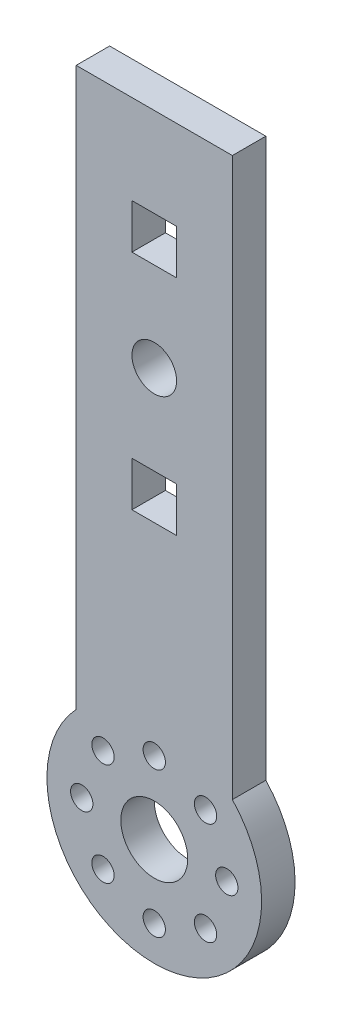
ISO-10303-21;
HEADER;
FILE_DESCRIPTION(('STEP AP214'),'2;1');
FILE_NAME('part.step','',(''),(''),'','','');
FILE_SCHEMA(('AUTOMOTIVE_DESIGN { 1 0 10303 214 1 1 1 1 }'));
ENDSEC;
DATA;
#1=APPLICATION_CONTEXT('core data for automotive mechanical design processes');
#2=APPLICATION_PROTOCOL_DEFINITION('international standard','automotive_design',2000,#1);
#3=PRODUCT_CONTEXT('',#1,'mechanical');
#4=PRODUCT('Part','Part','',(#3));
#5=PRODUCT_RELATED_PRODUCT_CATEGORY('part','',(#4));
#6=PRODUCT_DEFINITION_FORMATION('','',#4);
#7=PRODUCT_DEFINITION_CONTEXT('part definition',#1,'design');
#8=PRODUCT_DEFINITION('design','',#6,#7);
#9=PRODUCT_DEFINITION_SHAPE('','',#8);
#10=(LENGTH_UNIT() NAMED_UNIT(*) SI_UNIT(.MILLI.,.METRE.));
#11=(NAMED_UNIT(*) PLANE_ANGLE_UNIT() SI_UNIT($,.RADIAN.));
#12=(NAMED_UNIT(*) SI_UNIT($,.STERADIAN.) SOLID_ANGLE_UNIT());
#13=UNCERTAINTY_MEASURE_WITH_UNIT(LENGTH_MEASURE(1.E-05),#10,'distance_accuracy_value','');
#14=(GEOMETRIC_REPRESENTATION_CONTEXT(3) GLOBAL_UNCERTAINTY_ASSIGNED_CONTEXT((#13)) GLOBAL_UNIT_ASSIGNED_CONTEXT((#10,
#11,#12)) REPRESENTATION_CONTEXT('',''));
#15=CARTESIAN_POINT('',(0.,0.,0.));
#16=DIRECTION('',(0.,0.,1.));
#17=DIRECTION('',(1.,0.,0.));
#18=AXIS2_PLACEMENT_3D('',#15,#16,#17);
#19=CARTESIAN_POINT('',(0.,0.,0.));
#20=DIRECTION('',(0.,0.,1.));
#21=DIRECTION('',(1.,0.,0.));
#22=AXIS2_PLACEMENT_3D('',#19,#20,#21);
#23=PLANE('',#22);
#24=CARTESIAN_POINT('',(6.5,0.,0.));
#25=DIRECTION('',(0.,0.,-1.));
#26=DIRECTION('',(0.,1.,0.));
#27=AXIS2_PLACEMENT_3D('',#24,#25,#26);
#28=CIRCLE('',#27,1.);
#29=CARTESIAN_POINT('',(6.5,0.999999999999977,0.));
#30=VERTEX_POINT('',#29);
#31=EDGE_CURVE('E505',#30,#30,#28,.T.);
#32=ORIENTED_EDGE('',*,*,#31,.F.);
#33=EDGE_LOOP('',(#32));
#34=FACE_BOUND('',#33,.T.);
#35=CARTESIAN_POINT('',(4.59619407771253,-4.59619407771258,0.));
#36=DIRECTION('',(0.,0.,-1.));
#37=DIRECTION('',(0.707106781186551,0.707106781186544,0.));
#38=AXIS2_PLACEMENT_3D('',#35,#36,#37);
#39=CIRCLE('',#38,1.);
#40=CARTESIAN_POINT('',(5.30330085889909,-3.88908729652604,0.));
#41=VERTEX_POINT('',#40);
#42=EDGE_CURVE('E506',#41,#41,#39,.T.);
#43=ORIENTED_EDGE('',*,*,#42,.F.);
#44=EDGE_LOOP('',(#43));
#45=FACE_BOUND('',#44,.T.);
#46=CARTESIAN_POINT('',(0.,-6.5,0.));
#47=DIRECTION('',(0.,0.,-1.));
#48=DIRECTION('',(1.,0.,0.));
#49=AXIS2_PLACEMENT_3D('',#46,#47,#48);
#50=CIRCLE('',#49,1.);
#51=CARTESIAN_POINT('',(1.,-6.5,0.));
#52=VERTEX_POINT('',#51);
#53=EDGE_CURVE('E510',#52,#52,#50,.T.);
#54=ORIENTED_EDGE('',*,*,#53,.F.);
#55=EDGE_LOOP('',(#54));
#56=FACE_BOUND('',#55,.T.);
#57=CARTESIAN_POINT('',(-4.5961940777126,-4.59619407771252,0.));
#58=DIRECTION('',(0.,0.,-1.));
#59=DIRECTION('',(0.707106781186541,-0.707106781186554,0.));
#60=AXIS2_PLACEMENT_3D('',#57,#58,#59);
#61=CIRCLE('',#60,1.);
#62=CARTESIAN_POINT('',(-3.88908729652606,-5.30330085889907,0.));
#63=VERTEX_POINT('',#62);
#64=EDGE_CURVE('E517',#63,#63,#61,.T.);
#65=ORIENTED_EDGE('',*,*,#64,.F.);
#66=EDGE_LOOP('',(#65));
#67=FACE_BOUND('',#66,.T.);
#68=CARTESIAN_POINT('',(-6.5,0.,0.));
#69=DIRECTION('',(0.,0.,-1.));
#70=DIRECTION('',(0.,-1.,0.));
#71=AXIS2_PLACEMENT_3D('',#68,#69,#70);
#72=CIRCLE('',#71,1.);
#73=CARTESIAN_POINT('',(-6.50000000000001,-0.999999999999932,0.));
#74=VERTEX_POINT('',#73);
#75=EDGE_CURVE('E519',#74,#74,#72,.T.);
#76=ORIENTED_EDGE('',*,*,#75,.F.);
#77=EDGE_LOOP('',(#76));
#78=FACE_BOUND('',#77,.T.);
#79=CARTESIAN_POINT('',(-4.5961940777125,4.59619407771261,0.));
#80=DIRECTION('',(0.,0.,-1.));
#81=DIRECTION('',(-0.707106781186556,-0.707106781186539,0.));
#82=AXIS2_PLACEMENT_3D('',#79,#80,#81);
#83=CIRCLE('',#82,1.);
#84=CARTESIAN_POINT('',(-5.30330085889906,3.88908729652608,0.));
#85=VERTEX_POINT('',#84);
#86=EDGE_CURVE('E513',#85,#85,#83,.T.);
#87=ORIENTED_EDGE('',*,*,#86,.F.);
#88=EDGE_LOOP('',(#87));
#89=FACE_BOUND('',#88,.T.);
#90=CARTESIAN_POINT('',(4.59619407771257,4.59619407771255,0.));
#91=DIRECTION('',(0.,0.,-1.));
#92=DIRECTION('',(-0.707106781186546,0.707106781186549,0.));
#93=AXIS2_PLACEMENT_3D('',#90,#91,#92);
#94=CIRCLE('',#93,1.);
#95=CARTESIAN_POINT('',(3.88908729652602,5.3033008588991,0.));
#96=VERTEX_POINT('',#95);
#97=EDGE_CURVE('E259',#96,#96,#94,.T.);
#98=ORIENTED_EDGE('',*,*,#97,.F.);
#99=EDGE_LOOP('',(#98));
#100=FACE_BOUND('',#99,.T.);
#101=CARTESIAN_POINT('',(0.,36.6001430213842,0.));
#102=DIRECTION('',(0.,0.,-1.));
#103=DIRECTION('',(-1.,0.,0.));
#104=AXIS2_PLACEMENT_3D('',#101,#102,#103);
#105=CIRCLE('',#104,2.);
#106=CARTESIAN_POINT('',(-2.,36.6001430213842,0.));
#107=VERTEX_POINT('',#106);
#108=EDGE_CURVE('E254',#107,#107,#105,.T.);
#109=ORIENTED_EDGE('',*,*,#108,.F.);
#110=EDGE_LOOP('',(#109));
#111=FACE_BOUND('',#110,.T.);
#112=CARTESIAN_POINT('',(0.,6.5,0.));
#113=DIRECTION('',(0.,0.,-1.));
#114=DIRECTION('',(-1.,0.,0.));
#115=AXIS2_PLACEMENT_3D('',#112,#113,#114);
#116=CIRCLE('',#115,1.);
#117=CARTESIAN_POINT('',(-1.,6.5,0.));
#118=VERTEX_POINT('',#117);
#119=EDGE_CURVE('E250',#118,#118,#116,.T.);
#120=ORIENTED_EDGE('',*,*,#119,.F.);
#121=EDGE_LOOP('',(#120));
#122=FACE_BOUND('',#121,.T.);
#123=CARTESIAN_POINT('',(0.,0.,0.));
#124=DIRECTION('',(0.,0.,1.));
#125=DIRECTION('',(1.,0.,0.));
#126=AXIS2_PLACEMENT_3D('',#123,#124,#125);
#127=CIRCLE('',#126,3.);
#128=CARTESIAN_POINT('',(3.,0.,0.));
#129=VERTEX_POINT('',#128);
#130=EDGE_CURVE('E189',#129,#129,#127,.T.);
#131=ORIENTED_EDGE('',*,*,#130,.T.);
#132=EDGE_LOOP('',(#131));
#133=FACE_BOUND('',#132,.T.);
#134=DIRECTION('',(1.,0.,0.));
#135=VECTOR('',#134,1.);
#136=CARTESIAN_POINT('',(0.,48.6001430213842,0.));
#137=LINE('',#136,#135);
#138=CARTESIAN_POINT('',(-2.,48.6001430213842,0.));
#139=VERTEX_POINT('',#138);
#140=CARTESIAN_POINT('',(2.,48.6001430213842,0.));
#141=VERTEX_POINT('',#140);
#142=EDGE_CURVE('E77',#139,#141,#137,.T.);
#143=ORIENTED_EDGE('',*,*,#142,.F.);
#144=DIRECTION('',(0.,-1.,0.));
#145=VECTOR('',#144,1.);
#146=CARTESIAN_POINT('',(-1.99999999999999,0.,0.));
#147=LINE('',#146,#145);
#148=CARTESIAN_POINT('',(-2.,44.6001430213842,0.));
#149=VERTEX_POINT('',#148);
#150=EDGE_CURVE('E82',#139,#149,#147,.T.);
#151=ORIENTED_EDGE('',*,*,#150,.T.);
#152=DIRECTION('',(1.,0.,0.));
#153=VECTOR('',#152,1.);
#154=CARTESIAN_POINT('',(0.,44.6001430213842,0.));
#155=LINE('',#154,#153);
#156=CARTESIAN_POINT('',(2.,44.6001430213842,0.));
#157=VERTEX_POINT('',#156);
#158=EDGE_CURVE('E182',#149,#157,#155,.T.);
#159=ORIENTED_EDGE('',*,*,#158,.T.);
#160=DIRECTION('',(0.,-1.,0.));
#161=VECTOR('',#160,1.);
#162=CARTESIAN_POINT('',(2.00000000000001,0.,0.));
#163=LINE('',#162,#161);
#164=EDGE_CURVE('E179',#141,#157,#163,.T.);
#165=ORIENTED_EDGE('',*,*,#164,.F.);
#166=EDGE_LOOP('',(#143,#151,#159,#165));
#167=FACE_BOUND('',#166,.T.);
#168=DIRECTION('',(0.,1.,0.));
#169=VECTOR('',#168,1.);
#170=CARTESIAN_POINT('',(7.,0.,0.));
#171=LINE('',#170,#169);
#172=CARTESIAN_POINT('',(7.,6.60014302138418,0.));
#173=VERTEX_POINT('',#172);
#174=CARTESIAN_POINT('',(7.,56.6001430213842,0.));
#175=VERTEX_POINT('',#174);
#176=EDGE_CURVE('E229',#173,#175,#171,.T.);
#177=ORIENTED_EDGE('',*,*,#176,.F.);
#178=CARTESIAN_POINT('',(0.,0.,0.));
#179=DIRECTION('',(0.,0.,1.));
#180=DIRECTION('',(1.,0.,0.));
#181=AXIS2_PLACEMENT_3D('',#178,#179,#180);
#182=CIRCLE('',#181,9.62090889171737);
#183=CARTESIAN_POINT('',(-7.,6.60014302138418,0.));
#184=VERTEX_POINT('',#183);
#185=EDGE_CURVE('E207',#184,#173,#182,.T.);
#186=ORIENTED_EDGE('',*,*,#185,.F.);
#187=DIRECTION('',(0.,1.,0.));
#188=VECTOR('',#187,1.);
#189=CARTESIAN_POINT('',(-7.,0.,0.));
#190=LINE('',#189,#188);
#191=CARTESIAN_POINT('',(-7.,56.6001430213842,0.));
#192=VERTEX_POINT('',#191);
#193=EDGE_CURVE('E222',#184,#192,#190,.T.);
#194=ORIENTED_EDGE('',*,*,#193,.T.);
#195=DIRECTION('',(1.,0.,0.));
#196=VECTOR('',#195,1.);
#197=CARTESIAN_POINT('',(0.,56.6001430213842,0.));
#198=LINE('',#197,#196);
#199=EDGE_CURVE('E232',#192,#175,#198,.T.);
#200=ORIENTED_EDGE('',*,*,#199,.T.);
#201=EDGE_LOOP('',(#177,#186,#194,#200));
#202=FACE_BOUND('',#201,.T.);
#203=DIRECTION('',(1.,0.,0.));
#204=VECTOR('',#203,1.);
#205=CARTESIAN_POINT('',(0.,28.6001430213842,0.));
#206=LINE('',#205,#204);
#207=CARTESIAN_POINT('',(-2.,28.6001430213842,0.));
#208=VERTEX_POINT('',#207);
#209=CARTESIAN_POINT('',(2.,28.6001430213842,0.));
#210=VERTEX_POINT('',#209);
#211=EDGE_CURVE('E151',#208,#210,#206,.T.);
#212=ORIENTED_EDGE('',*,*,#211,.F.);
#213=DIRECTION('',(0.,-1.,0.));
#214=VECTOR('',#213,1.);
#215=CARTESIAN_POINT('',(-1.99999999999999,0.,0.));
#216=LINE('',#215,#214);
#217=CARTESIAN_POINT('',(-2.,24.6001430213842,0.));
#218=VERTEX_POINT('',#217);
#219=EDGE_CURVE('E171',#208,#218,#216,.T.);
#220=ORIENTED_EDGE('',*,*,#219,.T.);
#221=DIRECTION('',(1.,0.,0.));
#222=VECTOR('',#221,1.);
#223=CARTESIAN_POINT('',(0.,24.6001430213842,0.));
#224=LINE('',#223,#222);
#225=CARTESIAN_POINT('',(2.,24.6001430213842,0.));
#226=VERTEX_POINT('',#225);
#227=EDGE_CURVE('E154',#218,#226,#224,.T.);
#228=ORIENTED_EDGE('',*,*,#227,.T.);
#229=DIRECTION('',(0.,-1.,0.));
#230=VECTOR('',#229,1.);
#231=CARTESIAN_POINT('',(2.,0.,0.));
#232=LINE('',#231,#230);
#233=EDGE_CURVE('E148',#210,#226,#232,.T.);
#234=ORIENTED_EDGE('',*,*,#233,.F.);
#235=EDGE_LOOP('',(#212,#220,#228,#234));
#236=FACE_BOUND('',#235,.T.);
#237=ADVANCED_FACE('F60',(#34,#45,#56,#67,#78,#89,#100,#111,#122,#133,#167,#202,#236),#23,.F.);
#238=CARTESIAN_POINT('',(0.,0.,3.));
#239=DIRECTION('',(0.,0.,1.));
#240=DIRECTION('',(1.,0.,0.));
#241=AXIS2_PLACEMENT_3D('',#238,#239,#240);
#242=PLANE('',#241);
#243=CARTESIAN_POINT('',(6.5,0.,3.));
#244=DIRECTION('',(0.,0.,1.));
#245=DIRECTION('',(1.,0.,0.));
#246=AXIS2_PLACEMENT_3D('',#243,#244,#245);
#247=CIRCLE('',#246,1.);
#248=CARTESIAN_POINT('',(7.5,0.,3.));
#249=VERTEX_POINT('',#248);
#250=EDGE_CURVE('E64',#249,#249,#247,.T.);
#251=ORIENTED_EDGE('',*,*,#250,.F.);
#252=EDGE_LOOP('',(#251));
#253=FACE_BOUND('',#252,.T.);
#254=CARTESIAN_POINT('',(4.59619407771253,-4.59619407771258,3.));
#255=DIRECTION('',(0.,0.,1.));
#256=DIRECTION('',(1.,0.,0.));
#257=AXIS2_PLACEMENT_3D('',#254,#255,#256);
#258=CIRCLE('',#257,1.);
#259=CARTESIAN_POINT('',(5.59619407771253,-4.59619407771258,3.));
#260=VERTEX_POINT('',#259);
#261=EDGE_CURVE('E270',#260,#260,#258,.T.);
#262=ORIENTED_EDGE('',*,*,#261,.F.);
#263=EDGE_LOOP('',(#262));
#264=FACE_BOUND('',#263,.T.);
#265=CARTESIAN_POINT('',(0.,-6.5,3.));
#266=DIRECTION('',(0.,0.,1.));
#267=DIRECTION('',(1.,0.,0.));
#268=AXIS2_PLACEMENT_3D('',#265,#266,#267);
#269=CIRCLE('',#268,1.);
#270=CARTESIAN_POINT('',(1.,-6.5,3.));
#271=VERTEX_POINT('',#270);
#272=EDGE_CURVE('E268',#271,#271,#269,.T.);
#273=ORIENTED_EDGE('',*,*,#272,.F.);
#274=EDGE_LOOP('',(#273));
#275=FACE_BOUND('',#274,.T.);
#276=CARTESIAN_POINT('',(-4.5961940777126,-4.59619407771252,3.));
#277=DIRECTION('',(0.,0.,1.));
#278=DIRECTION('',(1.,0.,0.));
#279=AXIS2_PLACEMENT_3D('',#276,#277,#278);
#280=CIRCLE('',#279,1.);
#281=CARTESIAN_POINT('',(-3.5961940777126,-4.59619407771252,3.));
#282=VERTEX_POINT('',#281);
#283=EDGE_CURVE('E265',#282,#282,#280,.T.);
#284=ORIENTED_EDGE('',*,*,#283,.F.);
#285=EDGE_LOOP('',(#284));
#286=FACE_BOUND('',#285,.T.);
#287=CARTESIAN_POINT('',(-6.5,0.,3.));
#288=DIRECTION('',(0.,0.,1.));
#289=DIRECTION('',(1.,0.,0.));
#290=AXIS2_PLACEMENT_3D('',#287,#288,#289);
#291=CIRCLE('',#290,1.);
#292=CARTESIAN_POINT('',(-5.5,0.,3.));
#293=VERTEX_POINT('',#292);
#294=EDGE_CURVE('E262',#293,#293,#291,.T.);
#295=ORIENTED_EDGE('',*,*,#294,.F.);
#296=EDGE_LOOP('',(#295));
#297=FACE_BOUND('',#296,.T.);
#298=CARTESIAN_POINT('',(-4.5961940777125,4.59619407771261,3.));
#299=DIRECTION('',(0.,0.,1.));
#300=DIRECTION('',(1.,0.,0.));
#301=AXIS2_PLACEMENT_3D('',#298,#299,#300);
#302=CIRCLE('',#301,1.);
#303=CARTESIAN_POINT('',(-3.5961940777125,4.59619407771261,3.));
#304=VERTEX_POINT('',#303);
#305=EDGE_CURVE('E258',#304,#304,#302,.T.);
#306=ORIENTED_EDGE('',*,*,#305,.F.);
#307=EDGE_LOOP('',(#306));
#308=FACE_BOUND('',#307,.T.);
#309=CARTESIAN_POINT('',(4.59619407771257,4.59619407771255,3.));
#310=DIRECTION('',(0.,0.,1.));
#311=DIRECTION('',(1.,0.,0.));
#312=AXIS2_PLACEMENT_3D('',#309,#310,#311);
#313=CIRCLE('',#312,1.);
#314=CARTESIAN_POINT('',(5.59619407771257,4.59619407771255,3.));
#315=VERTEX_POINT('',#314);
#316=EDGE_CURVE('E255',#315,#315,#313,.T.);
#317=ORIENTED_EDGE('',*,*,#316,.F.);
#318=EDGE_LOOP('',(#317));
#319=FACE_BOUND('',#318,.T.);
#320=CARTESIAN_POINT('',(0.,36.6001430213842,3.));
#321=DIRECTION('',(0.,0.,1.));
#322=DIRECTION('',(1.,0.,0.));
#323=AXIS2_PLACEMENT_3D('',#320,#321,#322);
#324=CIRCLE('',#323,2.);
#325=CARTESIAN_POINT('',(2.,36.6001430213842,3.));
#326=VERTEX_POINT('',#325);
#327=EDGE_CURVE('E251',#326,#326,#324,.T.);
#328=ORIENTED_EDGE('',*,*,#327,.F.);
#329=EDGE_LOOP('',(#328));
#330=FACE_BOUND('',#329,.T.);
#331=CARTESIAN_POINT('',(0.,6.5,3.));
#332=DIRECTION('',(0.,0.,1.));
#333=DIRECTION('',(1.,0.,0.));
#334=AXIS2_PLACEMENT_3D('',#331,#332,#333);
#335=CIRCLE('',#334,1.);
#336=CARTESIAN_POINT('',(1.,6.5,3.));
#337=VERTEX_POINT('',#336);
#338=EDGE_CURVE('E246',#337,#337,#335,.T.);
#339=ORIENTED_EDGE('',*,*,#338,.F.);
#340=EDGE_LOOP('',(#339));
#341=FACE_BOUND('',#340,.T.);
#342=CARTESIAN_POINT('',(0.,0.,3.));
#343=DIRECTION('',(0.,0.,1.));
#344=DIRECTION('',(1.,0.,0.));
#345=AXIS2_PLACEMENT_3D('',#342,#343,#344);
#346=CIRCLE('',#345,3.);
#347=CARTESIAN_POINT('',(3.,0.,3.));
#348=VERTEX_POINT('',#347);
#349=EDGE_CURVE('E249',#348,#348,#346,.T.);
#350=ORIENTED_EDGE('',*,*,#349,.F.);
#351=EDGE_LOOP('',(#350));
#352=FACE_BOUND('',#351,.T.);
#353=DIRECTION('',(0.,-1.,0.));
#354=VECTOR('',#353,1.);
#355=CARTESIAN_POINT('',(-1.99999999999999,0.,3.));
#356=LINE('',#355,#354);
#357=CARTESIAN_POINT('',(-2.,48.6001430213842,3.));
#358=VERTEX_POINT('',#357);
#359=CARTESIAN_POINT('',(-2.,44.6001430213842,3.));
#360=VERTEX_POINT('',#359);
#361=EDGE_CURVE('E173',#358,#360,#356,.T.);
#362=ORIENTED_EDGE('',*,*,#361,.F.);
#363=DIRECTION('',(1.,0.,0.));
#364=VECTOR('',#363,1.);
#365=CARTESIAN_POINT('',(0.,48.6001430213842,3.));
#366=LINE('',#365,#364);
#367=CARTESIAN_POINT('',(2.,48.6001430213842,3.));
#368=VERTEX_POINT('',#367);
#369=EDGE_CURVE('E195',#358,#368,#366,.T.);
#370=ORIENTED_EDGE('',*,*,#369,.T.);
#371=DIRECTION('',(0.,-1.,0.));
#372=VECTOR('',#371,1.);
#373=CARTESIAN_POINT('',(2.00000000000001,0.,3.));
#374=LINE('',#373,#372);
#375=CARTESIAN_POINT('',(2.,44.6001430213842,3.));
#376=VERTEX_POINT('',#375);
#377=EDGE_CURVE('E198',#368,#376,#374,.T.);
#378=ORIENTED_EDGE('',*,*,#377,.T.);
#379=DIRECTION('',(1.,0.,0.));
#380=VECTOR('',#379,1.);
#381=CARTESIAN_POINT('',(0.,44.6001430213842,3.));
#382=LINE('',#381,#380);
#383=EDGE_CURVE('E201',#360,#376,#382,.T.);
#384=ORIENTED_EDGE('',*,*,#383,.F.);
#385=EDGE_LOOP('',(#362,#370,#378,#384));
#386=FACE_BOUND('',#385,.T.);
#387=DIRECTION('',(0.,1.,0.));
#388=VECTOR('',#387,1.);
#389=CARTESIAN_POINT('',(-7.,0.,3.));
#390=LINE('',#389,#388);
#391=CARTESIAN_POINT('',(-7.,6.60014302138418,3.));
#392=VERTEX_POINT('',#391);
#393=CARTESIAN_POINT('',(-7.,56.6001430213842,3.));
#394=VERTEX_POINT('',#393);
#395=EDGE_CURVE('E225',#392,#394,#390,.T.);
#396=ORIENTED_EDGE('',*,*,#395,.F.);
#397=CARTESIAN_POINT('',(0.,0.,3.));
#398=DIRECTION('',(0.,0.,1.));
#399=DIRECTION('',(1.,0.,0.));
#400=AXIS2_PLACEMENT_3D('',#397,#398,#399);
#401=CIRCLE('',#400,9.62090889171737);
#402=CARTESIAN_POINT('',(7.,6.60014302138418,3.));
#403=VERTEX_POINT('',#402);
#404=EDGE_CURVE('E233',#392,#403,#401,.T.);
#405=ORIENTED_EDGE('',*,*,#404,.T.);
#406=DIRECTION('',(0.,1.,0.));
#407=VECTOR('',#406,1.);
#408=CARTESIAN_POINT('',(7.,0.,3.));
#409=LINE('',#408,#407);
#410=CARTESIAN_POINT('',(7.,56.6001430213842,3.));
#411=VERTEX_POINT('',#410);
#412=EDGE_CURVE('E219',#403,#411,#409,.T.);
#413=ORIENTED_EDGE('',*,*,#412,.T.);
#414=DIRECTION('',(1.,0.,0.));
#415=VECTOR('',#414,1.);
#416=CARTESIAN_POINT('',(0.,56.6001430213842,3.));
#417=LINE('',#416,#415);
#418=EDGE_CURVE('E221',#394,#411,#417,.T.);
#419=ORIENTED_EDGE('',*,*,#418,.F.);
#420=EDGE_LOOP('',(#396,#405,#413,#419));
#421=FACE_BOUND('',#420,.T.);
#422=DIRECTION('',(0.,-1.,0.));
#423=VECTOR('',#422,1.);
#424=CARTESIAN_POINT('',(-1.99999999999999,0.,3.));
#425=LINE('',#424,#423);
#426=CARTESIAN_POINT('',(-2.,28.6001430213842,3.));
#427=VERTEX_POINT('',#426);
#428=CARTESIAN_POINT('',(-2.,24.6001430213842,3.));
#429=VERTEX_POINT('',#428);
#430=EDGE_CURVE('E185',#427,#429,#425,.T.);
#431=ORIENTED_EDGE('',*,*,#430,.F.);
#432=DIRECTION('',(1.,0.,0.));
#433=VECTOR('',#432,1.);
#434=CARTESIAN_POINT('',(0.,28.6001430213842,3.));
#435=LINE('',#434,#433);
#436=CARTESIAN_POINT('',(2.,28.6001430213842,3.));
#437=VERTEX_POINT('',#436);
#438=EDGE_CURVE('E188',#427,#437,#435,.T.);
#439=ORIENTED_EDGE('',*,*,#438,.T.);
#440=DIRECTION('',(0.,-1.,0.));
#441=VECTOR('',#440,1.);
#442=CARTESIAN_POINT('',(2.,0.,3.));
#443=LINE('',#442,#441);
#444=CARTESIAN_POINT('',(2.,24.6001430213842,3.));
#445=VERTEX_POINT('',#444);
#446=EDGE_CURVE('E162',#437,#445,#443,.T.);
#447=ORIENTED_EDGE('',*,*,#446,.T.);
#448=DIRECTION('',(1.,0.,0.));
#449=VECTOR('',#448,1.);
#450=CARTESIAN_POINT('',(0.,24.6001430213842,3.));
#451=LINE('',#450,#449);
#452=EDGE_CURVE('E192',#429,#445,#451,.T.);
#453=ORIENTED_EDGE('',*,*,#452,.F.);
#454=EDGE_LOOP('',(#431,#439,#447,#453));
#455=FACE_BOUND('',#454,.T.);
#456=ADVANCED_FACE('F309',(#253,#264,#275,#286,#297,#308,#319,#330,#341,#352,#386,#421,#455),
#242,.T.);
#457=CARTESIAN_POINT('',(7.,0.,3.));
#458=DIRECTION('',(-1.,0.,0.));
#459=DIRECTION('',(0.,0.,1.));
#460=AXIS2_PLACEMENT_3D('',#457,#458,#459);
#461=PLANE('',#460);
#462=ORIENTED_EDGE('',*,*,#176,.T.);
#463=DIRECTION('',(0.,0.,-1.));
#464=VECTOR('',#463,1.);
#465=CARTESIAN_POINT('',(7.,56.6001430213842,3.));
#466=LINE('',#465,#464);
#467=EDGE_CURVE('E69',#411,#175,#466,.T.);
#468=ORIENTED_EDGE('',*,*,#467,.F.);
#469=ORIENTED_EDGE('',*,*,#412,.F.);
#470=DIRECTION('',(0.,0.,-1.));
#471=VECTOR('',#470,1.);
#472=CARTESIAN_POINT('',(7.,6.60014302138418,3.));
#473=LINE('',#472,#471);
#474=EDGE_CURVE('E12',#403,#173,#473,.T.);
#475=ORIENTED_EDGE('',*,*,#474,.T.);
#476=EDGE_LOOP('',(#462,#468,#469,#475));
#477=FACE_BOUND('',#476,.T.);
#478=ADVANCED_FACE('F315',(#477),#461,.F.);
#479=CARTESIAN_POINT('',(0.,56.6001430213842,3.));
#480=DIRECTION('',(0.,1.,0.));
#481=DIRECTION('',(0.,0.,1.));
#482=AXIS2_PLACEMENT_3D('',#479,#480,#481);
#483=PLANE('',#482);
#484=ORIENTED_EDGE('',*,*,#199,.F.);
#485=DIRECTION('',(0.,0.,-1.));
#486=VECTOR('',#485,1.);
#487=CARTESIAN_POINT('',(-7.,56.6001430213842,3.));
#488=LINE('',#487,#486);
#489=EDGE_CURVE('E239',#394,#192,#488,.T.);
#490=ORIENTED_EDGE('',*,*,#489,.F.);
#491=ORIENTED_EDGE('',*,*,#418,.T.);
#492=ORIENTED_EDGE('',*,*,#467,.T.);
#493=EDGE_LOOP('',(#484,#490,#491,#492));
#494=FACE_BOUND('',#493,.T.);
#495=ADVANCED_FACE('F325',(#494),#483,.T.);
#496=CARTESIAN_POINT('',(-7.,0.,3.));
#497=DIRECTION('',(-1.,0.,0.));
#498=DIRECTION('',(0.,0.,1.));
#499=AXIS2_PLACEMENT_3D('',#496,#497,#498);
#500=PLANE('',#499);
#501=ORIENTED_EDGE('',*,*,#193,.F.);
#502=DIRECTION('',(0.,0.,-1.));
#503=VECTOR('',#502,1.);
#504=CARTESIAN_POINT('',(-7.,6.60014302138418,3.));
#505=LINE('',#504,#503);
#506=EDGE_CURVE('E228',#392,#184,#505,.T.);
#507=ORIENTED_EDGE('',*,*,#506,.F.);
#508=ORIENTED_EDGE('',*,*,#395,.T.);
#509=ORIENTED_EDGE('',*,*,#489,.T.);
#510=EDGE_LOOP('',(#501,#507,#508,#509));
#511=FACE_BOUND('',#510,.T.);
#512=ADVANCED_FACE('F322',(#511),#500,.T.);
#513=CARTESIAN_POINT('',(0.,0.,3.));
#514=DIRECTION('',(0.,0.,-1.));
#515=DIRECTION('',(-1.,0.,0.));
#516=AXIS2_PLACEMENT_3D('',#513,#514,#515);
#517=CYLINDRICAL_SURFACE('',#516,9.62090889171737);
#518=ORIENTED_EDGE('',*,*,#185,.T.);
#519=ORIENTED_EDGE('',*,*,#474,.F.);
#520=ORIENTED_EDGE('',*,*,#404,.F.);
#521=ORIENTED_EDGE('',*,*,#506,.T.);
#522=EDGE_LOOP('',(#518,#519,#520,#521));
#523=FACE_BOUND('',#522,.T.);
#524=ADVANCED_FACE('F62',(#523),#517,.T.);
#525=CARTESIAN_POINT('',(0.,28.6001430213842,0.));
#526=DIRECTION('',(0.,-1.,0.));
#527=DIRECTION('',(0.,0.,-1.));
#528=AXIS2_PLACEMENT_3D('',#525,#526,#527);
#529=PLANE('',#528);
#530=ORIENTED_EDGE('',*,*,#438,.F.);
#531=DIRECTION('',(0.,0.,1.));
#532=VECTOR('',#531,1.);
#533=CARTESIAN_POINT('',(-2.,28.6001430213842,0.));
#534=LINE('',#533,#532);
#535=EDGE_CURVE('E167',#208,#427,#534,.T.);
#536=ORIENTED_EDGE('',*,*,#535,.F.);
#537=ORIENTED_EDGE('',*,*,#211,.T.);
#538=DIRECTION('',(0.,0.,1.));
#539=VECTOR('',#538,1.);
#540=CARTESIAN_POINT('',(2.,28.6001430213842,0.));
#541=LINE('',#540,#539);
#542=EDGE_CURVE('E159',#210,#437,#541,.T.);
#543=ORIENTED_EDGE('',*,*,#542,.T.);
#544=EDGE_LOOP('',(#530,#536,#537,#543));
#545=FACE_BOUND('',#544,.T.);
#546=ADVANCED_FACE('F169',(#545),#529,.T.);
#547=CARTESIAN_POINT('',(2.,0.,0.));
#548=DIRECTION('',(-1.,0.,0.));
#549=DIRECTION('',(0.,-1.,0.));
#550=AXIS2_PLACEMENT_3D('',#547,#548,#549);
#551=PLANE('',#550);
#552=ORIENTED_EDGE('',*,*,#446,.F.);
#553=ORIENTED_EDGE('',*,*,#542,.F.);
#554=ORIENTED_EDGE('',*,*,#233,.T.);
#555=DIRECTION('',(0.,0.,1.));
#556=VECTOR('',#555,1.);
#557=CARTESIAN_POINT('',(2.,24.6001430213842,0.));
#558=LINE('',#557,#556);
#559=EDGE_CURVE('E166',#226,#445,#558,.T.);
#560=ORIENTED_EDGE('',*,*,#559,.T.);
#561=EDGE_LOOP('',(#552,#553,#554,#560));
#562=FACE_BOUND('',#561,.T.);
#563=ADVANCED_FACE('F160',(#562),#551,.T.);
#564=CARTESIAN_POINT('',(0.,24.6001430213842,0.));
#565=DIRECTION('',(0.,-1.,0.));
#566=DIRECTION('',(0.,0.,-1.));
#567=AXIS2_PLACEMENT_3D('',#564,#565,#566);
#568=PLANE('',#567);
#569=ORIENTED_EDGE('',*,*,#452,.T.);
#570=ORIENTED_EDGE('',*,*,#559,.F.);
#571=ORIENTED_EDGE('',*,*,#227,.F.);
#572=DIRECTION('',(0.,0.,1.));
#573=VECTOR('',#572,1.);
#574=CARTESIAN_POINT('',(-2.,24.6001430213842,0.));
#575=LINE('',#574,#573);
#576=EDGE_CURVE('E215',#218,#429,#575,.T.);
#577=ORIENTED_EDGE('',*,*,#576,.T.);
#578=EDGE_LOOP('',(#569,#570,#571,#577));
#579=FACE_BOUND('',#578,.T.);
#580=ADVANCED_FACE('F354',(#579),#568,.F.);
#581=CARTESIAN_POINT('',(-1.99999999999999,0.,0.));
#582=DIRECTION('',(-1.,0.,0.));
#583=DIRECTION('',(0.,-1.,0.));
#584=AXIS2_PLACEMENT_3D('',#581,#582,#583);
#585=PLANE('',#584);
#586=ORIENTED_EDGE('',*,*,#430,.T.);
#587=ORIENTED_EDGE('',*,*,#576,.F.);
#588=ORIENTED_EDGE('',*,*,#219,.F.);
#589=ORIENTED_EDGE('',*,*,#535,.T.);
#590=EDGE_LOOP('',(#586,#587,#588,#589));
#591=FACE_BOUND('',#590,.T.);
#592=ADVANCED_FACE('F357',(#591),#585,.F.);
#593=CARTESIAN_POINT('',(0.,48.6001430213842,0.));
#594=DIRECTION('',(0.,-1.,0.));
#595=DIRECTION('',(0.,0.,-1.));
#596=AXIS2_PLACEMENT_3D('',#593,#594,#595);
#597=PLANE('',#596);
#598=ORIENTED_EDGE('',*,*,#369,.F.);
#599=DIRECTION('',(0.,0.,1.));
#600=VECTOR('',#599,1.);
#601=CARTESIAN_POINT('',(-2.,48.6001430213842,0.));
#602=LINE('',#601,#600);
#603=EDGE_CURVE('E205',#139,#358,#602,.T.);
#604=ORIENTED_EDGE('',*,*,#603,.F.);
#605=ORIENTED_EDGE('',*,*,#142,.T.);
#606=DIRECTION('',(0.,0.,1.));
#607=VECTOR('',#606,1.);
#608=CARTESIAN_POINT('',(2.,48.6001430213842,0.));
#609=LINE('',#608,#607);
#610=EDGE_CURVE('E213',#141,#368,#609,.T.);
#611=ORIENTED_EDGE('',*,*,#610,.T.);
#612=EDGE_LOOP('',(#598,#604,#605,#611));
#613=FACE_BOUND('',#612,.T.);
#614=ADVANCED_FACE('F359',(#613),#597,.T.);
#615=CARTESIAN_POINT('',(-1.99999999999999,0.,0.));
#616=DIRECTION('',(-1.,0.,0.));
#617=DIRECTION('',(0.,-1.,0.));
#618=AXIS2_PLACEMENT_3D('',#615,#616,#617);
#619=PLANE('',#618);
#620=ORIENTED_EDGE('',*,*,#361,.T.);
#621=DIRECTION('',(0.,0.,1.));
#622=VECTOR('',#621,1.);
#623=CARTESIAN_POINT('',(-2.,44.6001430213842,0.));
#624=LINE('',#623,#622);
#625=EDGE_CURVE('E208',#149,#360,#624,.T.);
#626=ORIENTED_EDGE('',*,*,#625,.F.);
#627=ORIENTED_EDGE('',*,*,#150,.F.);
#628=ORIENTED_EDGE('',*,*,#603,.T.);
#629=EDGE_LOOP('',(#620,#626,#627,#628));
#630=FACE_BOUND('',#629,.T.);
#631=ADVANCED_FACE('F365',(#630),#619,.F.);
#632=CARTESIAN_POINT('',(0.,44.6001430213842,0.));
#633=DIRECTION('',(0.,-1.,0.));
#634=DIRECTION('',(0.,0.,-1.));
#635=AXIS2_PLACEMENT_3D('',#632,#633,#634);
#636=PLANE('',#635);
#637=ORIENTED_EDGE('',*,*,#383,.T.);
#638=DIRECTION('',(0.,0.,1.));
#639=VECTOR('',#638,1.);
#640=CARTESIAN_POINT('',(2.,44.6001430213842,0.));
#641=LINE('',#640,#639);
#642=EDGE_CURVE('E210',#157,#376,#641,.T.);
#643=ORIENTED_EDGE('',*,*,#642,.F.);
#644=ORIENTED_EDGE('',*,*,#158,.F.);
#645=ORIENTED_EDGE('',*,*,#625,.T.);
#646=EDGE_LOOP('',(#637,#643,#644,#645));
#647=FACE_BOUND('',#646,.T.);
#648=ADVANCED_FACE('F304',(#647),#636,.F.);
#649=CARTESIAN_POINT('',(2.00000000000001,0.,0.));
#650=DIRECTION('',(-1.,0.,0.));
#651=DIRECTION('',(0.,-1.,0.));
#652=AXIS2_PLACEMENT_3D('',#649,#650,#651);
#653=PLANE('',#652);
#654=ORIENTED_EDGE('',*,*,#377,.F.);
#655=ORIENTED_EDGE('',*,*,#610,.F.);
#656=ORIENTED_EDGE('',*,*,#164,.T.);
#657=ORIENTED_EDGE('',*,*,#642,.T.);
#658=EDGE_LOOP('',(#654,#655,#656,#657));
#659=FACE_BOUND('',#658,.T.);
#660=ADVANCED_FACE('F294',(#659),#653,.T.);
#661=CARTESIAN_POINT('',(0.,0.,-7.));
#662=DIRECTION('',(0.,0.,1.));
#663=DIRECTION('',(1.,0.,0.));
#664=AXIS2_PLACEMENT_3D('',#661,#662,#663);
#665=CYLINDRICAL_SURFACE('',#664,3.);
#666=ORIENTED_EDGE('',*,*,#349,.T.);
#667=EDGE_LOOP('',(#666));
#668=FACE_BOUND('',#667,.T.);
#669=ORIENTED_EDGE('',*,*,#130,.F.);
#670=EDGE_LOOP('',(#669));
#671=FACE_BOUND('',#670,.T.);
#672=ADVANCED_FACE('F291',(#668,#671),#665,.F.);
#673=CARTESIAN_POINT('',(0.,6.5,10.));
#674=DIRECTION('',(0.,0.,-1.));
#675=DIRECTION('',(-1.,0.,0.));
#676=AXIS2_PLACEMENT_3D('',#673,#674,#675);
#677=CYLINDRICAL_SURFACE('',#676,1.);
#678=ORIENTED_EDGE('',*,*,#338,.T.);
#679=EDGE_LOOP('',(#678));
#680=FACE_BOUND('',#679,.T.);
#681=ORIENTED_EDGE('',*,*,#119,.T.);
#682=EDGE_LOOP('',(#681));
#683=FACE_BOUND('',#682,.T.);
#684=ADVANCED_FACE('F293',(#680,#683),#677,.F.);
#685=CARTESIAN_POINT('',(0.,36.6001430213842,10.));
#686=DIRECTION('',(0.,0.,-1.));
#687=DIRECTION('',(-1.,0.,0.));
#688=AXIS2_PLACEMENT_3D('',#685,#686,#687);
#689=CYLINDRICAL_SURFACE('',#688,2.);
#690=ORIENTED_EDGE('',*,*,#327,.T.);
#691=EDGE_LOOP('',(#690));
#692=FACE_BOUND('',#691,.T.);
#693=ORIENTED_EDGE('',*,*,#108,.T.);
#694=EDGE_LOOP('',(#693));
#695=FACE_BOUND('',#694,.T.);
#696=ADVANCED_FACE('F301',(#692,#695),#689,.F.);
#697=CARTESIAN_POINT('',(4.59619407771257,4.59619407771255,10.));
#698=DIRECTION('',(0.,0.,-1.));
#699=DIRECTION('',(-1.,0.,0.));
#700=AXIS2_PLACEMENT_3D('',#697,#698,#699);
#701=CYLINDRICAL_SURFACE('',#700,1.);
#702=ORIENTED_EDGE('',*,*,#316,.T.);
#703=EDGE_LOOP('',(#702));
#704=FACE_BOUND('',#703,.T.);
#705=ORIENTED_EDGE('',*,*,#97,.T.);
#706=EDGE_LOOP('',(#705));
#707=FACE_BOUND('',#706,.T.);
#708=ADVANCED_FACE('F419',(#704,#707),#701,.F.);
#709=CARTESIAN_POINT('',(-4.5961940777125,4.59619407771261,10.));
#710=DIRECTION('',(0.,0.,-1.));
#711=DIRECTION('',(-1.,0.,0.));
#712=AXIS2_PLACEMENT_3D('',#709,#710,#711);
#713=CYLINDRICAL_SURFACE('',#712,1.);
#714=ORIENTED_EDGE('',*,*,#305,.T.);
#715=EDGE_LOOP('',(#714));
#716=FACE_BOUND('',#715,.T.);
#717=ORIENTED_EDGE('',*,*,#86,.T.);
#718=EDGE_LOOP('',(#717));
#719=FACE_BOUND('',#718,.T.);
#720=ADVANCED_FACE('F441',(#716,#719),#713,.F.);
#721=CARTESIAN_POINT('',(-6.5,0.,10.));
#722=DIRECTION('',(0.,0.,-1.));
#723=DIRECTION('',(-1.,0.,0.));
#724=AXIS2_PLACEMENT_3D('',#721,#722,#723);
#725=CYLINDRICAL_SURFACE('',#724,1.);
#726=ORIENTED_EDGE('',*,*,#294,.T.);
#727=EDGE_LOOP('',(#726));
#728=FACE_BOUND('',#727,.T.);
#729=ORIENTED_EDGE('',*,*,#75,.T.);
#730=EDGE_LOOP('',(#729));
#731=FACE_BOUND('',#730,.T.);
#732=ADVANCED_FACE('F451',(#728,#731),#725,.F.);
#733=CARTESIAN_POINT('',(-4.5961940777126,-4.59619407771252,10.));
#734=DIRECTION('',(0.,0.,-1.));
#735=DIRECTION('',(-1.,0.,0.));
#736=AXIS2_PLACEMENT_3D('',#733,#734,#735);
#737=CYLINDRICAL_SURFACE('',#736,1.);
#738=ORIENTED_EDGE('',*,*,#283,.T.);
#739=EDGE_LOOP('',(#738));
#740=FACE_BOUND('',#739,.T.);
#741=ORIENTED_EDGE('',*,*,#64,.T.);
#742=EDGE_LOOP('',(#741));
#743=FACE_BOUND('',#742,.T.);
#744=ADVANCED_FACE('F461',(#740,#743),#737,.F.);
#745=CARTESIAN_POINT('',(0.,-6.5,10.));
#746=DIRECTION('',(0.,0.,-1.));
#747=DIRECTION('',(-1.,0.,0.));
#748=AXIS2_PLACEMENT_3D('',#745,#746,#747);
#749=CYLINDRICAL_SURFACE('',#748,1.);
#750=ORIENTED_EDGE('',*,*,#272,.T.);
#751=EDGE_LOOP('',(#750));
#752=FACE_BOUND('',#751,.T.);
#753=ORIENTED_EDGE('',*,*,#53,.T.);
#754=EDGE_LOOP('',(#753));
#755=FACE_BOUND('',#754,.T.);
#756=ADVANCED_FACE('F471',(#752,#755),#749,.F.);
#757=CARTESIAN_POINT('',(4.59619407771253,-4.59619407771258,10.));
#758=DIRECTION('',(0.,0.,-1.));
#759=DIRECTION('',(-1.,0.,0.));
#760=AXIS2_PLACEMENT_3D('',#757,#758,#759);
#761=CYLINDRICAL_SURFACE('',#760,1.);
#762=ORIENTED_EDGE('',*,*,#261,.T.);
#763=EDGE_LOOP('',(#762));
#764=FACE_BOUND('',#763,.T.);
#765=ORIENTED_EDGE('',*,*,#42,.T.);
#766=EDGE_LOOP('',(#765));
#767=FACE_BOUND('',#766,.T.);
#768=ADVANCED_FACE('F481',(#764,#767),#761,.F.);
#769=CARTESIAN_POINT('',(6.5,0.,10.));
#770=DIRECTION('',(0.,0.,-1.));
#771=DIRECTION('',(-1.,0.,0.));
#772=AXIS2_PLACEMENT_3D('',#769,#770,#771);
#773=CYLINDRICAL_SURFACE('',#772,1.);
#774=ORIENTED_EDGE('',*,*,#250,.T.);
#775=EDGE_LOOP('',(#774));
#776=FACE_BOUND('',#775,.T.);
#777=ORIENTED_EDGE('',*,*,#31,.T.);
#778=EDGE_LOOP('',(#777));
#779=FACE_BOUND('',#778,.T.);
#780=ADVANCED_FACE('F491',(#776,#779),#773,.F.);
#781=CLOSED_SHELL('',(#237,#456,#478,#495,#512,#524,#546,#563,#580,#592,#614,#631,#648,#660,
#672,#684,#696,#708,#720,#732,#744,#756,#768,#780));
#782=MANIFOLD_SOLID_BREP('B2',#781);
#783=ADVANCED_BREP_SHAPE_REPRESENTATION('',(#18,#782),#14);
#784=SHAPE_DEFINITION_REPRESENTATION(#9,#783);
ENDSEC;
END-ISO-10303-21;
